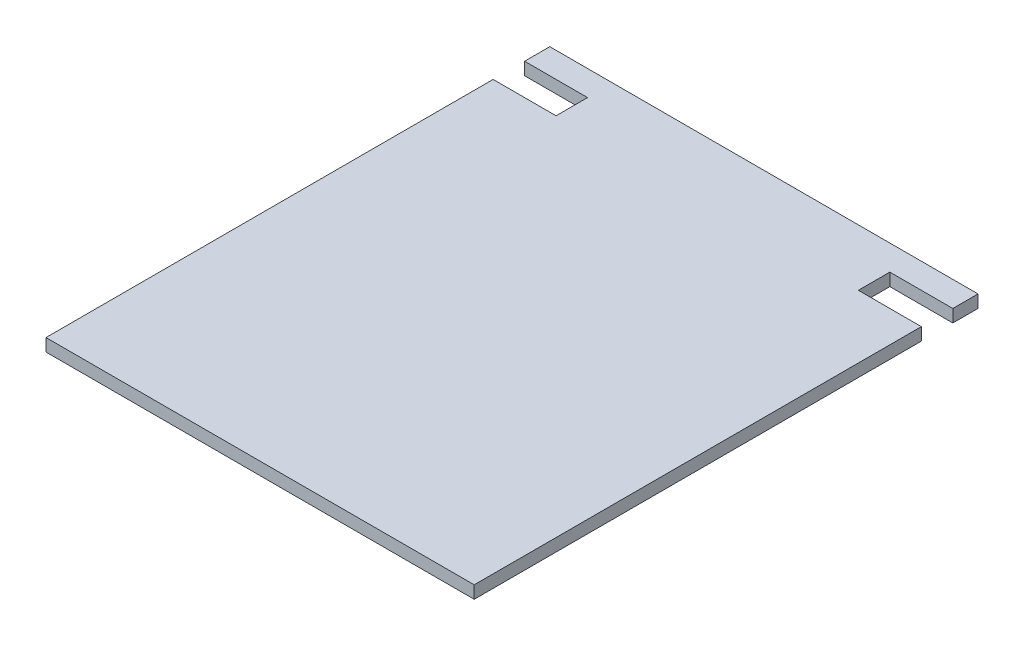
ISO-10303-21;
HEADER;
FILE_DESCRIPTION(('STEP AP214'),'2;1');
FILE_NAME('part.step','',(''),(''),'','','');
FILE_SCHEMA(('AUTOMOTIVE_DESIGN { 1 0 10303 214 1 1 1 1 }'));
ENDSEC;
DATA;
#1=APPLICATION_CONTEXT('core data for automotive mechanical design processes');
#2=APPLICATION_PROTOCOL_DEFINITION('international standard','automotive_design',2000,#1);
#3=PRODUCT_CONTEXT('',#1,'mechanical');
#4=PRODUCT('Part','Part','',(#3));
#5=PRODUCT_RELATED_PRODUCT_CATEGORY('part','',(#4));
#6=PRODUCT_DEFINITION_FORMATION('','',#4);
#7=PRODUCT_DEFINITION_CONTEXT('part definition',#1,'design');
#8=PRODUCT_DEFINITION('design','',#6,#7);
#9=PRODUCT_DEFINITION_SHAPE('','',#8);
#10=(LENGTH_UNIT() NAMED_UNIT(*) SI_UNIT(.MILLI.,.METRE.));
#11=(NAMED_UNIT(*) PLANE_ANGLE_UNIT() SI_UNIT($,.RADIAN.));
#12=(NAMED_UNIT(*) SI_UNIT($,.STERADIAN.) SOLID_ANGLE_UNIT());
#13=UNCERTAINTY_MEASURE_WITH_UNIT(LENGTH_MEASURE(1.E-05),#10,'distance_accuracy_value','');
#14=(GEOMETRIC_REPRESENTATION_CONTEXT(3) GLOBAL_UNCERTAINTY_ASSIGNED_CONTEXT((#13)) GLOBAL_UNIT_ASSIGNED_CONTEXT((#10,
#11,#12)) REPRESENTATION_CONTEXT('',''));
#15=CARTESIAN_POINT('',(0.,0.,0.));
#16=DIRECTION('',(0.,0.,1.));
#17=DIRECTION('',(1.,0.,0.));
#18=AXIS2_PLACEMENT_3D('',#15,#16,#17);
#19=CARTESIAN_POINT('',(170.,10.,200.));
#20=DIRECTION('',(-1.,0.,0.));
#21=DIRECTION('',(0.,0.,1.));
#22=AXIS2_PLACEMENT_3D('',#19,#20,#21);
#23=PLANE('',#22);
#24=DIRECTION('',(0.,0.,-1.));
#25=VECTOR('',#24,1.);
#26=CARTESIAN_POINT('',(170.,0.,200.));
#27=LINE('',#26,#25);
#28=CARTESIAN_POINT('',(170.,0.,200.));
#29=VERTEX_POINT('',#28);
#30=CARTESIAN_POINT('',(170.,0.,-155.));
#31=VERTEX_POINT('',#30);
#32=EDGE_CURVE('E150',#29,#31,#27,.T.);
#33=ORIENTED_EDGE('',*,*,#32,.T.);
#34=DIRECTION('',(0.,1.,0.));
#35=VECTOR('',#34,1.);
#36=CARTESIAN_POINT('',(170.,0.,-155.));
#37=LINE('',#36,#35);
#38=CARTESIAN_POINT('',(170.,10.,-155.));
#39=VERTEX_POINT('',#38);
#40=EDGE_CURVE('E182',#31,#39,#37,.T.);
#41=ORIENTED_EDGE('',*,*,#40,.T.);
#42=DIRECTION('',(0.,0.,-1.));
#43=VECTOR('',#42,1.);
#44=CARTESIAN_POINT('',(170.,10.,200.));
#45=LINE('',#44,#43);
#46=CARTESIAN_POINT('',(170.,10.,200.));
#47=VERTEX_POINT('',#46);
#48=EDGE_CURVE('E215',#47,#39,#45,.T.);
#49=ORIENTED_EDGE('',*,*,#48,.F.);
#50=DIRECTION('',(0.,-1.,0.));
#51=VECTOR('',#50,1.);
#52=CARTESIAN_POINT('',(170.,10.,200.));
#53=LINE('',#52,#51);
#54=EDGE_CURVE('E156',#47,#29,#53,.T.);
#55=ORIENTED_EDGE('',*,*,#54,.T.);
#56=EDGE_LOOP('',(#33,#41,#49,#55));
#57=FACE_BOUND('',#56,.T.);
#58=ADVANCED_FACE('F33',(#57),#23,.F.);
#59=CARTESIAN_POINT('',(-170.,10.,200.));
#60=DIRECTION('',(1.,0.,0.));
#61=DIRECTION('',(0.,0.,-1.));
#62=AXIS2_PLACEMENT_3D('',#59,#60,#61);
#63=PLANE('',#62);
#64=DIRECTION('',(0.,0.,1.));
#65=VECTOR('',#64,1.);
#66=CARTESIAN_POINT('',(-170.,0.,200.));
#67=LINE('',#66,#65);
#68=CARTESIAN_POINT('',(-170.,0.,-200.));
#69=VERTEX_POINT('',#68);
#70=CARTESIAN_POINT('',(-170.,0.,-180.));
#71=VERTEX_POINT('',#70);
#72=EDGE_CURVE('E146',#69,#71,#67,.T.);
#73=ORIENTED_EDGE('',*,*,#72,.T.);
#74=DIRECTION('',(0.,1.,0.));
#75=VECTOR('',#74,1.);
#76=CARTESIAN_POINT('',(-170.,0.,-180.));
#77=LINE('',#76,#75);
#78=CARTESIAN_POINT('',(-170.,10.,-180.));
#79=VERTEX_POINT('',#78);
#80=EDGE_CURVE('E186',#71,#79,#77,.T.);
#81=ORIENTED_EDGE('',*,*,#80,.T.);
#82=DIRECTION('',(0.,0.,1.));
#83=VECTOR('',#82,1.);
#84=CARTESIAN_POINT('',(-170.,10.,200.));
#85=LINE('',#84,#83);
#86=CARTESIAN_POINT('',(-170.,10.,-200.));
#87=VERTEX_POINT('',#86);
#88=EDGE_CURVE('E169',#87,#79,#85,.T.);
#89=ORIENTED_EDGE('',*,*,#88,.F.);
#90=DIRECTION('',(0.,-1.,0.));
#91=VECTOR('',#90,1.);
#92=CARTESIAN_POINT('',(-170.,10.,-200.));
#93=LINE('',#92,#91);
#94=EDGE_CURVE('E41',#87,#69,#93,.T.);
#95=ORIENTED_EDGE('',*,*,#94,.T.);
#96=EDGE_LOOP('',(#73,#81,#89,#95));
#97=FACE_BOUND('',#96,.T.);
#98=ADVANCED_FACE('F166',(#97),#63,.F.);
#99=CARTESIAN_POINT('',(170.,10.,-180.));
#100=VERTEX_POINT('',#99);
#101=CARTESIAN_POINT('',(170.,10.,-200.));
#102=VERTEX_POINT('',#101);
#103=EDGE_CURVE('E155',#100,#102,#45,.T.);
#104=ORIENTED_EDGE('',*,*,#103,.F.);
#105=DIRECTION('',(0.,1.,0.));
#106=VECTOR('',#105,1.);
#107=CARTESIAN_POINT('',(170.,0.,-180.));
#108=LINE('',#107,#106);
#109=CARTESIAN_POINT('',(170.,0.,-180.));
#110=VERTEX_POINT('',#109);
#111=EDGE_CURVE('E200',#110,#100,#108,.T.);
#112=ORIENTED_EDGE('',*,*,#111,.F.);
#113=CARTESIAN_POINT('',(170.,0.,-200.));
#114=VERTEX_POINT('',#113);
#115=EDGE_CURVE('E188',#110,#114,#27,.T.);
#116=ORIENTED_EDGE('',*,*,#115,.T.);
#117=DIRECTION('',(0.,-1.,0.));
#118=VECTOR('',#117,1.);
#119=CARTESIAN_POINT('',(170.,10.,-200.));
#120=LINE('',#119,#118);
#121=EDGE_CURVE('E11',#102,#114,#120,.T.);
#122=ORIENTED_EDGE('',*,*,#121,.F.);
#123=EDGE_LOOP('',(#104,#112,#116,#122));
#124=FACE_BOUND('',#123,.T.);
#125=ADVANCED_FACE('F35',(#124),#23,.F.);
#126=CARTESIAN_POINT('',(-170.,10.,-200.));
#127=DIRECTION('',(0.,0.,1.));
#128=DIRECTION('',(1.,0.,0.));
#129=AXIS2_PLACEMENT_3D('',#126,#127,#128);
#130=PLANE('',#129);
#131=DIRECTION('',(-1.,0.,0.));
#132=VECTOR('',#131,1.);
#133=CARTESIAN_POINT('',(-170.,0.,-200.));
#134=LINE('',#133,#132);
#135=EDGE_CURVE('E147',#114,#69,#134,.T.);
#136=ORIENTED_EDGE('',*,*,#135,.T.);
#137=ORIENTED_EDGE('',*,*,#94,.F.);
#138=DIRECTION('',(-1.,0.,0.));
#139=VECTOR('',#138,1.);
#140=CARTESIAN_POINT('',(-170.,10.,-200.));
#141=LINE('',#140,#139);
#142=EDGE_CURVE('E218',#102,#87,#141,.T.);
#143=ORIENTED_EDGE('',*,*,#142,.F.);
#144=ORIENTED_EDGE('',*,*,#121,.T.);
#145=EDGE_LOOP('',(#136,#137,#143,#144));
#146=FACE_BOUND('',#145,.T.);
#147=ADVANCED_FACE('F247',(#146),#130,.F.);
#148=CARTESIAN_POINT('',(-170.,10.,-155.));
#149=VERTEX_POINT('',#148);
#150=CARTESIAN_POINT('',(-170.,10.,200.));
#151=VERTEX_POINT('',#150);
#152=EDGE_CURVE('E138',#149,#151,#85,.T.);
#153=ORIENTED_EDGE('',*,*,#152,.F.);
#154=DIRECTION('',(0.,1.,0.));
#155=VECTOR('',#154,1.);
#156=CARTESIAN_POINT('',(-170.,0.,-155.));
#157=LINE('',#156,#155);
#158=CARTESIAN_POINT('',(-170.,0.,-155.));
#159=VERTEX_POINT('',#158);
#160=EDGE_CURVE('E125',#159,#149,#157,.T.);
#161=ORIENTED_EDGE('',*,*,#160,.F.);
#162=CARTESIAN_POINT('',(-170.,0.,200.));
#163=VERTEX_POINT('',#162);
#164=EDGE_CURVE('E136',#159,#163,#67,.T.);
#165=ORIENTED_EDGE('',*,*,#164,.T.);
#166=DIRECTION('',(0.,-1.,0.));
#167=VECTOR('',#166,1.);
#168=CARTESIAN_POINT('',(-170.,10.,200.));
#169=LINE('',#168,#167);
#170=EDGE_CURVE('E159',#151,#163,#169,.T.);
#171=ORIENTED_EDGE('',*,*,#170,.F.);
#172=EDGE_LOOP('',(#153,#161,#165,#171));
#173=FACE_BOUND('',#172,.T.);
#174=ADVANCED_FACE('F134',(#173),#63,.F.);
#175=CARTESIAN_POINT('',(-170.,10.,200.));
#176=DIRECTION('',(0.,0.,-1.));
#177=DIRECTION('',(-1.,0.,0.));
#178=AXIS2_PLACEMENT_3D('',#175,#176,#177);
#179=PLANE('',#178);
#180=DIRECTION('',(1.,0.,0.));
#181=VECTOR('',#180,1.);
#182=CARTESIAN_POINT('',(-170.,0.,200.));
#183=LINE('',#182,#181);
#184=EDGE_CURVE('E145',#163,#29,#183,.T.);
#185=ORIENTED_EDGE('',*,*,#184,.T.);
#186=ORIENTED_EDGE('',*,*,#54,.F.);
#187=DIRECTION('',(1.,0.,0.));
#188=VECTOR('',#187,1.);
#189=CARTESIAN_POINT('',(-170.,10.,200.));
#190=LINE('',#189,#188);
#191=EDGE_CURVE('E160',#151,#47,#190,.T.);
#192=ORIENTED_EDGE('',*,*,#191,.F.);
#193=ORIENTED_EDGE('',*,*,#170,.T.);
#194=EDGE_LOOP('',(#185,#186,#192,#193));
#195=FACE_BOUND('',#194,.T.);
#196=ADVANCED_FACE('F242',(#195),#179,.F.);
#197=CARTESIAN_POINT('',(0.,10.,0.));
#198=DIRECTION('',(0.,-1.,0.));
#199=DIRECTION('',(0.,0.,-1.));
#200=AXIS2_PLACEMENT_3D('',#197,#198,#199);
#201=PLANE('',#200);
#202=ORIENTED_EDGE('',*,*,#88,.T.);
#203=DIRECTION('',(-1.,0.,0.));
#204=VECTOR('',#203,1.);
#205=CARTESIAN_POINT('',(-170.,10.,-180.));
#206=LINE('',#205,#204);
#207=CARTESIAN_POINT('',(-120.,10.,-180.));
#208=VERTEX_POINT('',#207);
#209=EDGE_CURVE('E130',#208,#79,#206,.T.);
#210=ORIENTED_EDGE('',*,*,#209,.F.);
#211=DIRECTION('',(0.,0.,-1.));
#212=VECTOR('',#211,1.);
#213=CARTESIAN_POINT('',(-120.,10.,-180.));
#214=LINE('',#213,#212);
#215=CARTESIAN_POINT('',(-120.,10.,-155.));
#216=VERTEX_POINT('',#215);
#217=EDGE_CURVE('E181',#216,#208,#214,.T.);
#218=ORIENTED_EDGE('',*,*,#217,.F.);
#219=DIRECTION('',(1.,0.,0.));
#220=VECTOR('',#219,1.);
#221=CARTESIAN_POINT('',(-120.,10.,-155.));
#222=LINE('',#221,#220);
#223=EDGE_CURVE('E179',#149,#216,#222,.T.);
#224=ORIENTED_EDGE('',*,*,#223,.F.);
#225=ORIENTED_EDGE('',*,*,#152,.T.);
#226=ORIENTED_EDGE('',*,*,#191,.T.);
#227=ORIENTED_EDGE('',*,*,#48,.T.);
#228=DIRECTION('',(1.,0.,0.));
#229=VECTOR('',#228,1.);
#230=CARTESIAN_POINT('',(120.,10.,-155.));
#231=LINE('',#230,#229);
#232=CARTESIAN_POINT('',(120.,10.,-155.));
#233=VERTEX_POINT('',#232);
#234=EDGE_CURVE('E195',#233,#39,#231,.T.);
#235=ORIENTED_EDGE('',*,*,#234,.F.);
#236=DIRECTION('',(0.,0.,1.));
#237=VECTOR('',#236,1.);
#238=CARTESIAN_POINT('',(120.,10.,-180.));
#239=LINE('',#238,#237);
#240=CARTESIAN_POINT('',(120.,10.,-180.));
#241=VERTEX_POINT('',#240);
#242=EDGE_CURVE('E204',#241,#233,#239,.T.);
#243=ORIENTED_EDGE('',*,*,#242,.F.);
#244=DIRECTION('',(-1.,0.,0.));
#245=VECTOR('',#244,1.);
#246=CARTESIAN_POINT('',(170.,10.,-180.));
#247=LINE('',#246,#245);
#248=EDGE_CURVE('E201',#100,#241,#247,.T.);
#249=ORIENTED_EDGE('',*,*,#248,.F.);
#250=ORIENTED_EDGE('',*,*,#103,.T.);
#251=ORIENTED_EDGE('',*,*,#142,.T.);
#252=EDGE_LOOP('',(#202,#210,#218,#224,#225,#226,#227,#235,#243,#249,#250,#251));
#253=FACE_BOUND('',#252,.T.);
#254=ADVANCED_FACE('F235',(#253),#201,.F.);
#255=CARTESIAN_POINT('',(0.,0.,0.));
#256=DIRECTION('',(0.,-1.,0.));
#257=DIRECTION('',(0.,0.,-1.));
#258=AXIS2_PLACEMENT_3D('',#255,#256,#257);
#259=PLANE('',#258);
#260=DIRECTION('',(-1.,0.,0.));
#261=VECTOR('',#260,1.);
#262=CARTESIAN_POINT('',(-170.,0.,-180.));
#263=LINE('',#262,#261);
#264=CARTESIAN_POINT('',(-120.,0.,-180.));
#265=VERTEX_POINT('',#264);
#266=EDGE_CURVE('E139',#265,#71,#263,.T.);
#267=ORIENTED_EDGE('',*,*,#266,.T.);
#268=ORIENTED_EDGE('',*,*,#72,.F.);
#269=ORIENTED_EDGE('',*,*,#135,.F.);
#270=ORIENTED_EDGE('',*,*,#115,.F.);
#271=DIRECTION('',(-1.,0.,0.));
#272=VECTOR('',#271,1.);
#273=CARTESIAN_POINT('',(170.,0.,-180.));
#274=LINE('',#273,#272);
#275=CARTESIAN_POINT('',(120.,0.,-180.));
#276=VERTEX_POINT('',#275);
#277=EDGE_CURVE('E192',#110,#276,#274,.T.);
#278=ORIENTED_EDGE('',*,*,#277,.T.);
#279=DIRECTION('',(0.,0.,1.));
#280=VECTOR('',#279,1.);
#281=CARTESIAN_POINT('',(120.,0.,-180.));
#282=LINE('',#281,#280);
#283=CARTESIAN_POINT('',(120.,0.,-155.));
#284=VERTEX_POINT('',#283);
#285=EDGE_CURVE('E56',#276,#284,#282,.T.);
#286=ORIENTED_EDGE('',*,*,#285,.T.);
#287=DIRECTION('',(1.,0.,0.));
#288=VECTOR('',#287,1.);
#289=CARTESIAN_POINT('',(120.,0.,-155.));
#290=LINE('',#289,#288);
#291=EDGE_CURVE('E197',#284,#31,#290,.T.);
#292=ORIENTED_EDGE('',*,*,#291,.T.);
#293=ORIENTED_EDGE('',*,*,#32,.F.);
#294=ORIENTED_EDGE('',*,*,#184,.F.);
#295=ORIENTED_EDGE('',*,*,#164,.F.);
#296=DIRECTION('',(1.,0.,0.));
#297=VECTOR('',#296,1.);
#298=CARTESIAN_POINT('',(-120.,0.,-155.));
#299=LINE('',#298,#297);
#300=CARTESIAN_POINT('',(-120.,0.,-155.));
#301=VERTEX_POINT('',#300);
#302=EDGE_CURVE('E121',#159,#301,#299,.T.);
#303=ORIENTED_EDGE('',*,*,#302,.T.);
#304=DIRECTION('',(0.,0.,-1.));
#305=VECTOR('',#304,1.);
#306=CARTESIAN_POINT('',(-120.,0.,-180.));
#307=LINE('',#306,#305);
#308=EDGE_CURVE('E48',#301,#265,#307,.T.);
#309=ORIENTED_EDGE('',*,*,#308,.T.);
#310=EDGE_LOOP('',(#267,#268,#269,#270,#278,#286,#292,#293,#294,#295,#303,#309));
#311=FACE_BOUND('',#310,.T.);
#312=ADVANCED_FACE('F143',(#311),#259,.T.);
#313=CARTESIAN_POINT('',(120.,0.,-155.));
#314=DIRECTION('',(0.,0.,1.));
#315=DIRECTION('',(1.,0.,0.));
#316=AXIS2_PLACEMENT_3D('',#313,#314,#315);
#317=PLANE('',#316);
#318=ORIENTED_EDGE('',*,*,#234,.T.);
#319=ORIENTED_EDGE('',*,*,#40,.F.);
#320=ORIENTED_EDGE('',*,*,#291,.F.);
#321=DIRECTION('',(0.,1.,0.));
#322=VECTOR('',#321,1.);
#323=CARTESIAN_POINT('',(120.,0.,-155.));
#324=LINE('',#323,#322);
#325=EDGE_CURVE('E210',#284,#233,#324,.T.);
#326=ORIENTED_EDGE('',*,*,#325,.T.);
#327=EDGE_LOOP('',(#318,#319,#320,#326));
#328=FACE_BOUND('',#327,.T.);
#329=ADVANCED_FACE('F238',(#328),#317,.F.);
#330=CARTESIAN_POINT('',(120.,0.,-180.));
#331=DIRECTION('',(-1.,0.,0.));
#332=DIRECTION('',(0.,0.,1.));
#333=AXIS2_PLACEMENT_3D('',#330,#331,#332);
#334=PLANE('',#333);
#335=ORIENTED_EDGE('',*,*,#242,.T.);
#336=ORIENTED_EDGE('',*,*,#325,.F.);
#337=ORIENTED_EDGE('',*,*,#285,.F.);
#338=DIRECTION('',(0.,1.,0.));
#339=VECTOR('',#338,1.);
#340=CARTESIAN_POINT('',(120.,0.,-180.));
#341=LINE('',#340,#339);
#342=EDGE_CURVE('E212',#276,#241,#341,.T.);
#343=ORIENTED_EDGE('',*,*,#342,.T.);
#344=EDGE_LOOP('',(#335,#336,#337,#343));
#345=FACE_BOUND('',#344,.T.);
#346=ADVANCED_FACE('F231',(#345),#334,.F.);
#347=CARTESIAN_POINT('',(170.,0.,-180.));
#348=DIRECTION('',(0.,0.,-1.));
#349=DIRECTION('',(-1.,0.,0.));
#350=AXIS2_PLACEMENT_3D('',#347,#348,#349);
#351=PLANE('',#350);
#352=ORIENTED_EDGE('',*,*,#248,.T.);
#353=ORIENTED_EDGE('',*,*,#342,.F.);
#354=ORIENTED_EDGE('',*,*,#277,.F.);
#355=ORIENTED_EDGE('',*,*,#111,.T.);
#356=EDGE_LOOP('',(#352,#353,#354,#355));
#357=FACE_BOUND('',#356,.T.);
#358=ADVANCED_FACE('F228',(#357),#351,.F.);
#359=CARTESIAN_POINT('',(-170.,0.,-180.));
#360=DIRECTION('',(0.,0.,-1.));
#361=DIRECTION('',(-1.,0.,0.));
#362=AXIS2_PLACEMENT_3D('',#359,#360,#361);
#363=PLANE('',#362);
#364=ORIENTED_EDGE('',*,*,#209,.T.);
#365=ORIENTED_EDGE('',*,*,#80,.F.);
#366=ORIENTED_EDGE('',*,*,#266,.F.);
#367=DIRECTION('',(0.,1.,0.));
#368=VECTOR('',#367,1.);
#369=CARTESIAN_POINT('',(-120.,0.,-180.));
#370=LINE('',#369,#368);
#371=EDGE_CURVE('E189',#265,#208,#370,.T.);
#372=ORIENTED_EDGE('',*,*,#371,.T.);
#373=EDGE_LOOP('',(#364,#365,#366,#372));
#374=FACE_BOUND('',#373,.T.);
#375=ADVANCED_FACE('F246',(#374),#363,.F.);
#376=CARTESIAN_POINT('',(-120.,0.,-180.));
#377=DIRECTION('',(1.,0.,0.));
#378=DIRECTION('',(0.,0.,-1.));
#379=AXIS2_PLACEMENT_3D('',#376,#377,#378);
#380=PLANE('',#379);
#381=ORIENTED_EDGE('',*,*,#217,.T.);
#382=ORIENTED_EDGE('',*,*,#371,.F.);
#383=ORIENTED_EDGE('',*,*,#308,.F.);
#384=DIRECTION('',(0.,1.,0.));
#385=VECTOR('',#384,1.);
#386=CARTESIAN_POINT('',(-120.,0.,-155.));
#387=LINE('',#386,#385);
#388=EDGE_CURVE('E127',#301,#216,#387,.T.);
#389=ORIENTED_EDGE('',*,*,#388,.T.);
#390=EDGE_LOOP('',(#381,#382,#383,#389));
#391=FACE_BOUND('',#390,.T.);
#392=ADVANCED_FACE('F245',(#391),#380,.F.);
#393=CARTESIAN_POINT('',(-120.,0.,-155.));
#394=DIRECTION('',(0.,0.,1.));
#395=DIRECTION('',(1.,0.,0.));
#396=AXIS2_PLACEMENT_3D('',#393,#394,#395);
#397=PLANE('',#396);
#398=ORIENTED_EDGE('',*,*,#223,.T.);
#399=ORIENTED_EDGE('',*,*,#388,.F.);
#400=ORIENTED_EDGE('',*,*,#302,.F.);
#401=ORIENTED_EDGE('',*,*,#160,.T.);
#402=EDGE_LOOP('',(#398,#399,#400,#401));
#403=FACE_BOUND('',#402,.T.);
#404=ADVANCED_FACE('F124',(#403),#397,.F.);
#405=CLOSED_SHELL('',(#58,#98,#125,#147,#174,#196,#254,#312,#329,#346,#358,#375,#392,#404));
#406=MANIFOLD_SOLID_BREP('B2',#405);
#407=ADVANCED_BREP_SHAPE_REPRESENTATION('',(#18,#406),#14);
#408=SHAPE_DEFINITION_REPRESENTATION(#9,#407);
ENDSEC;
END-ISO-10303-21;
